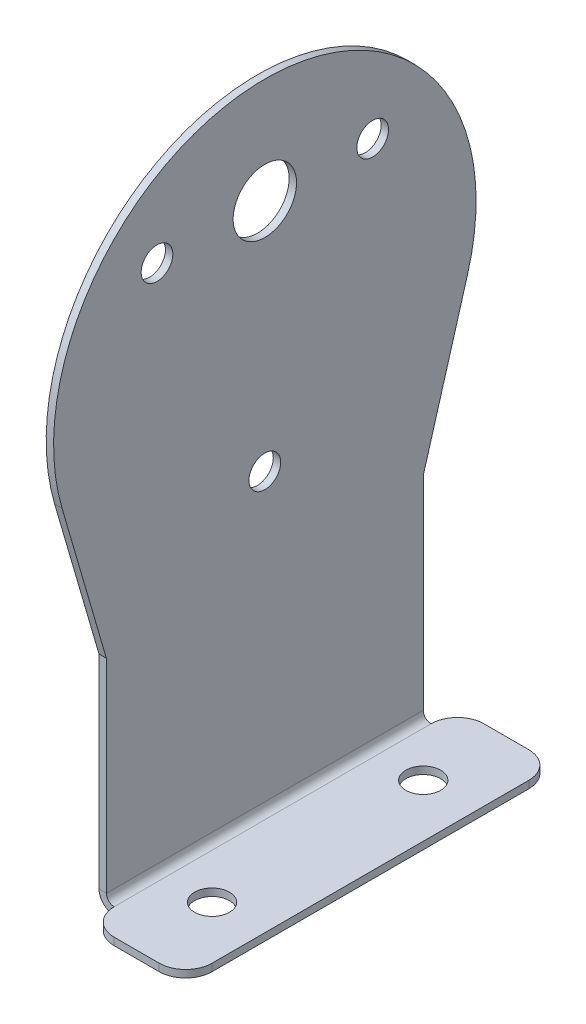
ISO-10303-21;
HEADER;
FILE_DESCRIPTION(('STEP AP214'),'2;1');
FILE_NAME('part.step','',(''),(''),'','','');
FILE_SCHEMA(('AUTOMOTIVE_DESIGN { 1 0 10303 214 1 1 1 1 }'));
ENDSEC;
DATA;
#1=APPLICATION_CONTEXT('core data for automotive mechanical design processes');
#2=APPLICATION_PROTOCOL_DEFINITION('international standard','automotive_design',2000,#1);
#3=PRODUCT_CONTEXT('',#1,'mechanical');
#4=PRODUCT('Part','Part','',(#3));
#5=PRODUCT_RELATED_PRODUCT_CATEGORY('part','',(#4));
#6=PRODUCT_DEFINITION_FORMATION('','',#4);
#7=PRODUCT_DEFINITION_CONTEXT('part definition',#1,'design');
#8=PRODUCT_DEFINITION('design','',#6,#7);
#9=PRODUCT_DEFINITION_SHAPE('','',#8);
#10=(LENGTH_UNIT() NAMED_UNIT(*) SI_UNIT(.MILLI.,.METRE.));
#11=(NAMED_UNIT(*) PLANE_ANGLE_UNIT() SI_UNIT($,.RADIAN.));
#12=(NAMED_UNIT(*) SI_UNIT($,.STERADIAN.) SOLID_ANGLE_UNIT());
#13=UNCERTAINTY_MEASURE_WITH_UNIT(LENGTH_MEASURE(1.E-05),#10,'distance_accuracy_value','');
#14=(GEOMETRIC_REPRESENTATION_CONTEXT(3) GLOBAL_UNCERTAINTY_ASSIGNED_CONTEXT((#13)) GLOBAL_UNIT_ASSIGNED_CONTEXT((#10,
#11,#12)) REPRESENTATION_CONTEXT('',''));
#15=CARTESIAN_POINT('',(0.,0.,0.));
#16=DIRECTION('',(0.,0.,1.));
#17=DIRECTION('',(1.,0.,0.));
#18=AXIS2_PLACEMENT_3D('',#15,#16,#17);
#19=CARTESIAN_POINT('',(-0.7,-20.,-15.));
#20=DIRECTION('',(0.,0.,-1.));
#21=DIRECTION('',(0.,1.,0.));
#22=AXIS2_PLACEMENT_3D('',#19,#20,#21);
#23=PLANE('',#22);
#24=DIRECTION('',(0.,1.,0.));
#25=VECTOR('',#24,1.);
#26=CARTESIAN_POINT('',(0.,-20.,-15.));
#27=LINE('',#26,#25);
#28=CARTESIAN_POINT('',(0.,-39.2634,-15.));
#29=VERTEX_POINT('',#28);
#30=CARTESIAN_POINT('',(0.,-20.,-15.));
#31=VERTEX_POINT('',#30);
#32=EDGE_CURVE('E257',#29,#31,#27,.T.);
#33=ORIENTED_EDGE('',*,*,#32,.F.);
#34=DIRECTION('',(-1.,0.,0.));
#35=VECTOR('',#34,1.);
#36=CARTESIAN_POINT('',(0.,-39.2634,-15.));
#37=LINE('',#36,#35);
#38=CARTESIAN_POINT('',(-0.700000000000004,-39.2634,-15.));
#39=VERTEX_POINT('',#38);
#40=EDGE_CURVE('E222',#29,#39,#37,.T.);
#41=ORIENTED_EDGE('',*,*,#40,.T.);
#42=DIRECTION('',(0.,1.,0.));
#43=VECTOR('',#42,1.);
#44=CARTESIAN_POINT('',(-0.7,-20.,-15.));
#45=LINE('',#44,#43);
#46=CARTESIAN_POINT('',(-0.7,-20.,-15.));
#47=VERTEX_POINT('',#46);
#48=EDGE_CURVE('E260',#39,#47,#45,.T.);
#49=ORIENTED_EDGE('',*,*,#48,.T.);
#50=DIRECTION('',(1.,0.,0.));
#51=VECTOR('',#50,1.);
#52=CARTESIAN_POINT('',(-0.7,-20.,-15.));
#53=LINE('',#52,#51);
#54=EDGE_CURVE('E275',#47,#31,#53,.T.);
#55=ORIENTED_EDGE('',*,*,#54,.T.);
#56=EDGE_LOOP('',(#33,#41,#49,#55));
#57=FACE_BOUND('',#56,.T.);
#58=ADVANCED_FACE('F36',(#57),#23,.T.);
#59=CARTESIAN_POINT('',(-0.7,0.,0.));
#60=DIRECTION('',(1.,0.,0.));
#61=DIRECTION('',(0.,0.,-1.));
#62=AXIS2_PLACEMENT_3D('',#59,#60,#61);
#63=PLANE('',#62);
#64=CARTESIAN_POINT('',(-0.7,10.,10.2108));
#65=DIRECTION('',(1.,0.,0.));
#66=DIRECTION('',(0.,0.,-1.));
#67=AXIS2_PLACEMENT_3D('',#64,#65,#66);
#68=CIRCLE('',#67,1.5);
#69=CARTESIAN_POINT('',(-0.7,10.,8.7108));
#70=VERTEX_POINT('',#69);
#71=EDGE_CURVE('E254',#70,#70,#68,.T.);
#72=ORIENTED_EDGE('',*,*,#71,.T.);
#73=EDGE_LOOP('',(#72));
#74=FACE_BOUND('',#73,.T.);
#75=CARTESIAN_POINT('',(-0.7,10.,-10.2108));
#76=DIRECTION('',(1.,0.,0.));
#77=DIRECTION('',(0.,0.,-1.));
#78=AXIS2_PLACEMENT_3D('',#75,#76,#77);
#79=CIRCLE('',#78,1.5);
#80=CARTESIAN_POINT('',(-0.7,10.,-11.7108));
#81=VERTEX_POINT('',#80);
#82=EDGE_CURVE('E248',#81,#81,#79,.T.);
#83=ORIENTED_EDGE('',*,*,#82,.T.);
#84=EDGE_LOOP('',(#83));
#85=FACE_BOUND('',#84,.T.);
#86=CARTESIAN_POINT('',(-0.7,10.,0.));
#87=DIRECTION('',(1.,0.,0.));
#88=DIRECTION('',(0.,0.,-1.));
#89=AXIS2_PLACEMENT_3D('',#86,#87,#88);
#90=CIRCLE('',#89,3.);
#91=CARTESIAN_POINT('',(-0.7,10.,-3.));
#92=VERTEX_POINT('',#91);
#93=EDGE_CURVE('E242',#92,#92,#90,.T.);
#94=ORIENTED_EDGE('',*,*,#93,.T.);
#95=EDGE_LOOP('',(#94));
#96=FACE_BOUND('',#95,.T.);
#97=CARTESIAN_POINT('',(-0.7,-12.1742,0.));
#98=DIRECTION('',(1.,0.,0.));
#99=DIRECTION('',(0.,0.,-1.));
#100=AXIS2_PLACEMENT_3D('',#97,#98,#99);
#101=CIRCLE('',#100,1.5);
#102=CARTESIAN_POINT('',(-0.7,-12.1742,-1.5));
#103=VERTEX_POINT('',#102);
#104=EDGE_CURVE('E236',#103,#103,#101,.T.);
#105=ORIENTED_EDGE('',*,*,#104,.T.);
#106=EDGE_LOOP('',(#105));
#107=FACE_BOUND('',#106,.T.);
#108=DIRECTION('',(0.,0.,-1.));
#109=VECTOR('',#108,1.);
#110=CARTESIAN_POINT('',(-0.700000000000004,-39.2634,-15.));
#111=LINE('',#110,#109);
#112=CARTESIAN_POINT('',(-0.7,-39.2634,15.));
#113=VERTEX_POINT('',#112);
#114=EDGE_CURVE('E145',#39,#113,#111,.F.);
#115=ORIENTED_EDGE('',*,*,#114,.T.);
#116=DIRECTION('',(0.,-1.,0.));
#117=VECTOR('',#116,1.);
#118=CARTESIAN_POINT('',(-0.7,-20.,15.));
#119=LINE('',#118,#117);
#120=CARTESIAN_POINT('',(-0.7,-20.,15.));
#121=VERTEX_POINT('',#120);
#122=EDGE_CURVE('E272',#121,#113,#119,.T.);
#123=ORIENTED_EDGE('',*,*,#122,.F.);
#124=DIRECTION('',(0.,-0.96,-0.28));
#125=VECTOR('',#124,1.);
#126=CARTESIAN_POINT('',(-0.7,-5.6,19.2));
#127=LINE('',#126,#125);
#128=CARTESIAN_POINT('',(-0.7,-5.6,19.2));
#129=VERTEX_POINT('',#128);
#130=EDGE_CURVE('E269',#129,#121,#127,.T.);
#131=ORIENTED_EDGE('',*,*,#130,.F.);
#132=CARTESIAN_POINT('',(-0.7,0.,0.));
#133=DIRECTION('',(1.,0.,0.));
#134=DIRECTION('',(0.,0.,-1.));
#135=AXIS2_PLACEMENT_3D('',#132,#133,#134);
#136=CIRCLE('',#135,20.);
#137=CARTESIAN_POINT('',(-0.7,-5.60000000000001,-19.2));
#138=VERTEX_POINT('',#137);
#139=EDGE_CURVE('E266',#138,#129,#136,.T.);
#140=ORIENTED_EDGE('',*,*,#139,.F.);
#141=DIRECTION('',(0.,0.96,-0.28));
#142=VECTOR('',#141,1.);
#143=CARTESIAN_POINT('',(-0.7,-20.,-15.));
#144=LINE('',#143,#142);
#145=EDGE_CURVE('E262',#47,#138,#144,.T.);
#146=ORIENTED_EDGE('',*,*,#145,.F.);
#147=ORIENTED_EDGE('',*,*,#48,.F.);
#148=EDGE_LOOP('',(#115,#123,#131,#140,#146,#147));
#149=FACE_BOUND('',#148,.T.);
#150=ADVANCED_FACE('F358',(#74,#85,#96,#107,#149),#63,.F.);
#151=CARTESIAN_POINT('',(0.,0.,0.));
#152=DIRECTION('',(1.,0.,0.));
#153=DIRECTION('',(0.,0.,-1.));
#154=AXIS2_PLACEMENT_3D('',#151,#152,#153);
#155=PLANE('',#154);
#156=CARTESIAN_POINT('',(0.,10.,10.2108));
#157=DIRECTION('',(1.,0.,0.));
#158=DIRECTION('',(0.,0.,-1.));
#159=AXIS2_PLACEMENT_3D('',#156,#157,#158);
#160=CIRCLE('',#159,1.5);
#161=CARTESIAN_POINT('',(0.,10.,8.7108));
#162=VERTEX_POINT('',#161);
#163=EDGE_CURVE('E251',#162,#162,#160,.T.);
#164=ORIENTED_EDGE('',*,*,#163,.F.);
#165=EDGE_LOOP('',(#164));
#166=FACE_BOUND('',#165,.T.);
#167=CARTESIAN_POINT('',(0.,10.,-10.2108));
#168=DIRECTION('',(1.,0.,0.));
#169=DIRECTION('',(0.,0.,-1.));
#170=AXIS2_PLACEMENT_3D('',#167,#168,#169);
#171=CIRCLE('',#170,1.5);
#172=CARTESIAN_POINT('',(0.,10.,-11.7108));
#173=VERTEX_POINT('',#172);
#174=EDGE_CURVE('E245',#173,#173,#171,.T.);
#175=ORIENTED_EDGE('',*,*,#174,.F.);
#176=EDGE_LOOP('',(#175));
#177=FACE_BOUND('',#176,.T.);
#178=CARTESIAN_POINT('',(0.,10.,0.));
#179=DIRECTION('',(1.,0.,0.));
#180=DIRECTION('',(0.,0.,-1.));
#181=AXIS2_PLACEMENT_3D('',#178,#179,#180);
#182=CIRCLE('',#181,3.);
#183=CARTESIAN_POINT('',(0.,10.,-3.));
#184=VERTEX_POINT('',#183);
#185=EDGE_CURVE('E239',#184,#184,#182,.T.);
#186=ORIENTED_EDGE('',*,*,#185,.F.);
#187=EDGE_LOOP('',(#186));
#188=FACE_BOUND('',#187,.T.);
#189=CARTESIAN_POINT('',(0.,-12.1742,0.));
#190=DIRECTION('',(1.,0.,0.));
#191=DIRECTION('',(0.,0.,-1.));
#192=AXIS2_PLACEMENT_3D('',#189,#190,#191);
#193=CIRCLE('',#192,1.5);
#194=CARTESIAN_POINT('',(0.,-12.1742,-1.5));
#195=VERTEX_POINT('',#194);
#196=EDGE_CURVE('E233',#195,#195,#193,.T.);
#197=ORIENTED_EDGE('',*,*,#196,.F.);
#198=EDGE_LOOP('',(#197));
#199=FACE_BOUND('',#198,.T.);
#200=DIRECTION('',(0.,-1.,0.));
#201=VECTOR('',#200,1.);
#202=CARTESIAN_POINT('',(0.,-20.,15.));
#203=LINE('',#202,#201);
#204=CARTESIAN_POINT('',(0.,-20.,15.));
#205=VERTEX_POINT('',#204);
#206=CARTESIAN_POINT('',(0.,-39.2634,15.));
#207=VERTEX_POINT('',#206);
#208=EDGE_CURVE('E263',#205,#207,#203,.T.);
#209=ORIENTED_EDGE('',*,*,#208,.T.);
#210=DIRECTION('',(0.,0.,-1.));
#211=VECTOR('',#210,1.);
#212=CARTESIAN_POINT('',(0.,-39.2634,-15.));
#213=LINE('',#212,#211);
#214=EDGE_CURVE('E226',#29,#207,#213,.F.);
#215=ORIENTED_EDGE('',*,*,#214,.F.);
#216=ORIENTED_EDGE('',*,*,#32,.T.);
#217=DIRECTION('',(0.,0.96,-0.28));
#218=VECTOR('',#217,1.);
#219=CARTESIAN_POINT('',(0.,-20.,-15.));
#220=LINE('',#219,#218);
#221=CARTESIAN_POINT('',(0.,-5.60000000000001,-19.2));
#222=VERTEX_POINT('',#221);
#223=EDGE_CURVE('E277',#31,#222,#220,.T.);
#224=ORIENTED_EDGE('',*,*,#223,.T.);
#225=CARTESIAN_POINT('',(0.,0.,0.));
#226=DIRECTION('',(1.,0.,0.));
#227=DIRECTION('',(0.,0.,-1.));
#228=AXIS2_PLACEMENT_3D('',#225,#226,#227);
#229=CIRCLE('',#228,20.);
#230=CARTESIAN_POINT('',(0.,-5.6,19.2));
#231=VERTEX_POINT('',#230);
#232=EDGE_CURVE('E280',#222,#231,#229,.T.);
#233=ORIENTED_EDGE('',*,*,#232,.T.);
#234=DIRECTION('',(0.,-0.96,-0.28));
#235=VECTOR('',#234,1.);
#236=CARTESIAN_POINT('',(0.,-5.6,19.2));
#237=LINE('',#236,#235);
#238=EDGE_CURVE('E283',#231,#205,#237,.T.);
#239=ORIENTED_EDGE('',*,*,#238,.T.);
#240=EDGE_LOOP('',(#209,#215,#216,#224,#233,#239));
#241=FACE_BOUND('',#240,.T.);
#242=ADVANCED_FACE('F302',(#166,#177,#188,#199,#241),#155,.T.);
#243=CARTESIAN_POINT('',(-0.7,-20.,15.));
#244=DIRECTION('',(0.,0.,1.));
#245=DIRECTION('',(0.,-1.,0.));
#246=AXIS2_PLACEMENT_3D('',#243,#244,#245);
#247=PLANE('',#246);
#248=DIRECTION('',(-1.,0.,0.));
#249=VECTOR('',#248,1.);
#250=CARTESIAN_POINT('',(0.,-39.2634,15.));
#251=LINE('',#250,#249);
#252=EDGE_CURVE('E230',#207,#113,#251,.T.);
#253=ORIENTED_EDGE('',*,*,#252,.F.);
#254=ORIENTED_EDGE('',*,*,#208,.F.);
#255=DIRECTION('',(1.,0.,0.));
#256=VECTOR('',#255,1.);
#257=CARTESIAN_POINT('',(-0.7,-20.,15.));
#258=LINE('',#257,#256);
#259=EDGE_CURVE('E201',#121,#205,#258,.T.);
#260=ORIENTED_EDGE('',*,*,#259,.F.);
#261=ORIENTED_EDGE('',*,*,#122,.T.);
#262=EDGE_LOOP('',(#253,#254,#260,#261));
#263=FACE_BOUND('',#262,.T.);
#264=ADVANCED_FACE('F376',(#263),#247,.T.);
#265=CARTESIAN_POINT('',(-0.7,-5.6,19.2));
#266=DIRECTION('',(0.,-0.28,0.96));
#267=DIRECTION('',(0.,-0.96,-0.28));
#268=AXIS2_PLACEMENT_3D('',#265,#266,#267);
#269=PLANE('',#268);
#270=ORIENTED_EDGE('',*,*,#238,.F.);
#271=DIRECTION('',(1.,0.,0.));
#272=VECTOR('',#271,1.);
#273=CARTESIAN_POINT('',(-0.7,-5.6,19.2));
#274=LINE('',#273,#272);
#275=EDGE_CURVE('E289',#129,#231,#274,.T.);
#276=ORIENTED_EDGE('',*,*,#275,.F.);
#277=ORIENTED_EDGE('',*,*,#130,.T.);
#278=ORIENTED_EDGE('',*,*,#259,.T.);
#279=EDGE_LOOP('',(#270,#276,#277,#278));
#280=FACE_BOUND('',#279,.T.);
#281=ADVANCED_FACE('F372',(#280),#269,.T.);
#282=CARTESIAN_POINT('',(-0.7,0.,0.));
#283=DIRECTION('',(1.,0.,0.));
#284=DIRECTION('',(0.,0.,-1.));
#285=AXIS2_PLACEMENT_3D('',#282,#283,#284);
#286=CYLINDRICAL_SURFACE('',#285,20.);
#287=ORIENTED_EDGE('',*,*,#232,.F.);
#288=DIRECTION('',(1.,0.,0.));
#289=VECTOR('',#288,1.);
#290=CARTESIAN_POINT('',(-0.7,-5.60000000000001,-19.2));
#291=LINE('',#290,#289);
#292=EDGE_CURVE('E291',#138,#222,#291,.T.);
#293=ORIENTED_EDGE('',*,*,#292,.F.);
#294=ORIENTED_EDGE('',*,*,#139,.T.);
#295=ORIENTED_EDGE('',*,*,#275,.T.);
#296=EDGE_LOOP('',(#287,#293,#294,#295));
#297=FACE_BOUND('',#296,.T.);
#298=ADVANCED_FACE('F369',(#297),#286,.T.);
#299=CARTESIAN_POINT('',(-0.7,-20.,-15.));
#300=DIRECTION('',(0.,-0.28,-0.96));
#301=DIRECTION('',(0.,0.96,-0.28));
#302=AXIS2_PLACEMENT_3D('',#299,#300,#301);
#303=PLANE('',#302);
#304=ORIENTED_EDGE('',*,*,#223,.F.);
#305=ORIENTED_EDGE('',*,*,#54,.F.);
#306=ORIENTED_EDGE('',*,*,#145,.T.);
#307=ORIENTED_EDGE('',*,*,#292,.T.);
#308=EDGE_LOOP('',(#304,#305,#306,#307));
#309=FACE_BOUND('',#308,.T.);
#310=ADVANCED_FACE('F299',(#309),#303,.T.);
#311=CARTESIAN_POINT('',(-0.7,10.,10.2108));
#312=DIRECTION('',(1.,0.,0.));
#313=DIRECTION('',(0.,0.,-1.));
#314=AXIS2_PLACEMENT_3D('',#311,#312,#313);
#315=CYLINDRICAL_SURFACE('',#314,1.5);
#316=ORIENTED_EDGE('',*,*,#71,.F.);
#317=EDGE_LOOP('',(#316));
#318=FACE_BOUND('',#317,.T.);
#319=ORIENTED_EDGE('',*,*,#163,.T.);
#320=EDGE_LOOP('',(#319));
#321=FACE_BOUND('',#320,.T.);
#322=ADVANCED_FACE('F368',(#318,#321),#315,.F.);
#323=CARTESIAN_POINT('',(-0.7,10.,-10.2108));
#324=DIRECTION('',(1.,0.,0.));
#325=DIRECTION('',(0.,0.,-1.));
#326=AXIS2_PLACEMENT_3D('',#323,#324,#325);
#327=CYLINDRICAL_SURFACE('',#326,1.5);
#328=ORIENTED_EDGE('',*,*,#82,.F.);
#329=EDGE_LOOP('',(#328));
#330=FACE_BOUND('',#329,.T.);
#331=ORIENTED_EDGE('',*,*,#174,.T.);
#332=EDGE_LOOP('',(#331));
#333=FACE_BOUND('',#332,.T.);
#334=ADVANCED_FACE('F386',(#330,#333),#327,.F.);
#335=CARTESIAN_POINT('',(-0.7,10.,0.));
#336=DIRECTION('',(1.,0.,0.));
#337=DIRECTION('',(0.,0.,-1.));
#338=AXIS2_PLACEMENT_3D('',#335,#336,#337);
#339=CYLINDRICAL_SURFACE('',#338,3.);
#340=ORIENTED_EDGE('',*,*,#93,.F.);
#341=EDGE_LOOP('',(#340));
#342=FACE_BOUND('',#341,.T.);
#343=ORIENTED_EDGE('',*,*,#185,.T.);
#344=EDGE_LOOP('',(#343));
#345=FACE_BOUND('',#344,.T.);
#346=ADVANCED_FACE('F390',(#342,#345),#339,.F.);
#347=CARTESIAN_POINT('',(-0.7,-12.1742,0.));
#348=DIRECTION('',(1.,0.,0.));
#349=DIRECTION('',(0.,0.,-1.));
#350=AXIS2_PLACEMENT_3D('',#347,#348,#349);
#351=CYLINDRICAL_SURFACE('',#350,1.5);
#352=ORIENTED_EDGE('',*,*,#104,.F.);
#353=EDGE_LOOP('',(#352));
#354=FACE_BOUND('',#353,.T.);
#355=ORIENTED_EDGE('',*,*,#196,.T.);
#356=EDGE_LOOP('',(#355));
#357=FACE_BOUND('',#356,.T.);
#358=ADVANCED_FACE('F394',(#354,#357),#351,.F.);
#359=CARTESIAN_POINT('',(0.736599999999999,-39.2634,15.));
#360=DIRECTION('',(0.,0.,1.));
#361=DIRECTION('',(1.,0.,0.));
#362=AXIS2_PLACEMENT_3D('',#359,#360,#361);
#363=PLANE('',#362);
#364=DIRECTION('',(0.,-1.,0.));
#365=VECTOR('',#364,1.);
#366=CARTESIAN_POINT('',(0.736599999999997,-40.,15.));
#367=LINE('',#366,#365);
#368=CARTESIAN_POINT('',(0.736599999999997,-40.,15.));
#369=VERTEX_POINT('',#368);
#370=CARTESIAN_POINT('',(0.736599999999994,-40.7,15.));
#371=VERTEX_POINT('',#370);
#372=EDGE_CURVE('E192',#369,#371,#367,.T.);
#373=ORIENTED_EDGE('',*,*,#372,.F.);
#374=CARTESIAN_POINT('',(0.736599999999999,-39.2634,15.));
#375=DIRECTION('',(0.,0.,-1.));
#376=DIRECTION('',(-1.,0.,0.));
#377=AXIS2_PLACEMENT_3D('',#374,#375,#376);
#378=CIRCLE('',#377,0.736599999999997);
#379=EDGE_CURVE('E148',#207,#369,#378,.F.);
#380=ORIENTED_EDGE('',*,*,#379,.F.);
#381=ORIENTED_EDGE('',*,*,#252,.T.);
#382=CARTESIAN_POINT('',(0.736599999999999,-39.2634,15.));
#383=DIRECTION('',(0.,0.,-1.));
#384=DIRECTION('',(-1.,0.,0.));
#385=AXIS2_PLACEMENT_3D('',#382,#383,#384);
#386=CIRCLE('',#385,1.4366);
#387=EDGE_CURVE('E221',#113,#371,#386,.F.);
#388=ORIENTED_EDGE('',*,*,#387,.T.);
#389=EDGE_LOOP('',(#373,#380,#381,#388));
#390=FACE_BOUND('',#389,.T.);
#391=ADVANCED_FACE('F311',(#390),#363,.T.);
#392=CARTESIAN_POINT('',(0.736599999999993,-39.2634,-15.));
#393=DIRECTION('',(0.,0.,1.));
#394=DIRECTION('',(1.,0.,0.));
#395=AXIS2_PLACEMENT_3D('',#392,#393,#394);
#396=PLANE('',#395);
#397=CARTESIAN_POINT('',(0.736599999999993,-39.2634,-15.));
#398=DIRECTION('',(0.,0.,-1.));
#399=DIRECTION('',(-1.,0.,0.));
#400=AXIS2_PLACEMENT_3D('',#397,#398,#399);
#401=CIRCLE('',#400,0.736599999999997);
#402=CARTESIAN_POINT('',(0.736599999999997,-40.,-15.));
#403=VERTEX_POINT('',#402);
#404=EDGE_CURVE('E155',#403,#29,#401,.T.);
#405=ORIENTED_EDGE('',*,*,#404,.F.);
#406=DIRECTION('',(0.,-1.,0.));
#407=VECTOR('',#406,1.);
#408=CARTESIAN_POINT('',(0.73659999999999,-40.,-15.));
#409=LINE('',#408,#407);
#410=CARTESIAN_POINT('',(0.736599999999994,-40.7,-15.));
#411=VERTEX_POINT('',#410);
#412=EDGE_CURVE('E152',#403,#411,#409,.T.);
#413=ORIENTED_EDGE('',*,*,#412,.T.);
#414=CARTESIAN_POINT('',(0.736599999999993,-39.2634,-15.));
#415=DIRECTION('',(0.,0.,-1.));
#416=DIRECTION('',(-1.,0.,0.));
#417=AXIS2_PLACEMENT_3D('',#414,#415,#416);
#418=CIRCLE('',#417,1.4366);
#419=EDGE_CURVE('E139',#411,#39,#418,.T.);
#420=ORIENTED_EDGE('',*,*,#419,.T.);
#421=ORIENTED_EDGE('',*,*,#40,.F.);
#422=EDGE_LOOP('',(#405,#413,#420,#421));
#423=FACE_BOUND('',#422,.T.);
#424=ADVANCED_FACE('F153',(#423),#396,.F.);
#425=CARTESIAN_POINT('',(0.736599999999993,-39.2634,-15.));
#426=DIRECTION('',(0.,0.,-1.));
#427=DIRECTION('',(0.,-1.,0.));
#428=AXIS2_PLACEMENT_3D('',#425,#426,#427);
#429=CYLINDRICAL_SURFACE('',#428,1.4366);
#430=ORIENTED_EDGE('',*,*,#114,.F.);
#431=ORIENTED_EDGE('',*,*,#419,.F.);
#432=DIRECTION('',(0.,0.,1.));
#433=VECTOR('',#432,1.);
#434=CARTESIAN_POINT('',(0.736599999999991,-40.7,0.));
#435=LINE('',#434,#433);
#436=EDGE_CURVE('E143',#411,#371,#435,.T.);
#437=ORIENTED_EDGE('',*,*,#436,.T.);
#438=ORIENTED_EDGE('',*,*,#387,.F.);
#439=EDGE_LOOP('',(#430,#431,#437,#438));
#440=FACE_BOUND('',#439,.T.);
#441=ADVANCED_FACE('F141',(#440),#429,.T.);
#442=CARTESIAN_POINT('',(0.736599999999993,-39.2634,-15.));
#443=DIRECTION('',(0.,0.,-1.));
#444=DIRECTION('',(0.,-1.,0.));
#445=AXIS2_PLACEMENT_3D('',#442,#443,#444);
#446=CYLINDRICAL_SURFACE('',#445,0.736599999999997);
#447=ORIENTED_EDGE('',*,*,#214,.T.);
#448=ORIENTED_EDGE('',*,*,#379,.T.);
#449=DIRECTION('',(0.,0.,-1.));
#450=VECTOR('',#449,1.);
#451=CARTESIAN_POINT('',(0.736599999999997,-40.,15.));
#452=LINE('',#451,#450);
#453=EDGE_CURVE('E157',#369,#403,#452,.T.);
#454=ORIENTED_EDGE('',*,*,#453,.T.);
#455=ORIENTED_EDGE('',*,*,#404,.T.);
#456=EDGE_LOOP('',(#447,#448,#454,#455));
#457=FACE_BOUND('',#456,.T.);
#458=ADVANCED_FACE('F306',(#457),#446,.F.);
#459=CARTESIAN_POINT('',(-1.41221915015335E-13,-40.7,0.));
#460=DIRECTION('',(0.,1.,0.));
#461=DIRECTION('',(-1.,0.,0.));
#462=AXIS2_PLACEMENT_3D('',#459,#460,#461);
#463=PLANE('',#462);
#464=CARTESIAN_POINT('',(4.99999999999993,-40.7,9.99999999999999));
#465=DIRECTION('',(0.,1.,0.));
#466=DIRECTION('',(1.,0.,0.));
#467=AXIS2_PLACEMENT_3D('',#464,#465,#466);
#468=CIRCLE('',#467,1.65);
#469=CARTESIAN_POINT('',(6.64999999999993,-40.7,9.99999999999999));
#470=VERTEX_POINT('',#469);
#471=EDGE_CURVE('E326',#470,#470,#468,.T.);
#472=ORIENTED_EDGE('',*,*,#471,.T.);
#473=EDGE_LOOP('',(#472));
#474=FACE_BOUND('',#473,.T.);
#475=CARTESIAN_POINT('',(4.99999999999993,-40.7,-10.));
#476=DIRECTION('',(0.,1.,0.));
#477=DIRECTION('',(-1.,0.,0.));
#478=AXIS2_PLACEMENT_3D('',#475,#476,#477);
#479=CIRCLE('',#478,1.65);
#480=CARTESIAN_POINT('',(3.34999999999993,-40.7,-10.));
#481=VERTEX_POINT('',#480);
#482=EDGE_CURVE('E321',#481,#481,#479,.T.);
#483=ORIENTED_EDGE('',*,*,#482,.T.);
#484=EDGE_LOOP('',(#483));
#485=FACE_BOUND('',#484,.T.);
#486=DIRECTION('',(0.,0.,1.));
#487=VECTOR('',#486,1.);
#488=CARTESIAN_POINT('',(10.,-40.7,15.));
#489=LINE('',#488,#487);
#490=CARTESIAN_POINT('',(10.,-40.7,-15.));
#491=VERTEX_POINT('',#490);
#492=CARTESIAN_POINT('',(10.,-40.7,15.));
#493=VERTEX_POINT('',#492);
#494=EDGE_CURVE('E180',#491,#493,#489,.T.);
#495=ORIENTED_EDGE('',*,*,#494,.T.);
#496=CARTESIAN_POINT('',(7.5,-40.7,15.));
#497=DIRECTION('',(0.,1.,0.));
#498=DIRECTION('',(-1.,0.,0.));
#499=AXIS2_PLACEMENT_3D('',#496,#497,#498);
#500=CIRCLE('',#499,2.5);
#501=CARTESIAN_POINT('',(7.5,-40.7,17.5));
#502=VERTEX_POINT('',#501);
#503=EDGE_CURVE('E170',#493,#502,#500,.F.);
#504=ORIENTED_EDGE('',*,*,#503,.T.);
#505=DIRECTION('',(1.,0.,0.));
#506=VECTOR('',#505,1.);
#507=CARTESIAN_POINT('',(0.736599999999995,-40.7,17.5));
#508=LINE('',#507,#506);
#509=CARTESIAN_POINT('',(3.23659999999999,-40.7,17.5));
#510=VERTEX_POINT('',#509);
#511=EDGE_CURVE('E178',#510,#502,#508,.T.);
#512=ORIENTED_EDGE('',*,*,#511,.F.);
#513=CARTESIAN_POINT('',(3.23659999999999,-40.7,15.));
#514=DIRECTION('',(0.,1.,0.));
#515=DIRECTION('',(-1.,0.,0.));
#516=AXIS2_PLACEMENT_3D('',#513,#514,#515);
#517=CIRCLE('',#516,2.5);
#518=EDGE_CURVE('E163',#510,#371,#517,.F.);
#519=ORIENTED_EDGE('',*,*,#518,.T.);
#520=ORIENTED_EDGE('',*,*,#436,.F.);
#521=CARTESIAN_POINT('',(3.23659999999999,-40.7,-15.));
#522=DIRECTION('',(0.,1.,0.));
#523=DIRECTION('',(-1.,0.,0.));
#524=AXIS2_PLACEMENT_3D('',#521,#522,#523);
#525=CIRCLE('',#524,2.5);
#526=CARTESIAN_POINT('',(3.23659999999999,-40.7,-17.5));
#527=VERTEX_POINT('',#526);
#528=EDGE_CURVE('E57',#411,#527,#525,.F.);
#529=ORIENTED_EDGE('',*,*,#528,.T.);
#530=DIRECTION('',(1.,0.,0.));
#531=VECTOR('',#530,1.);
#532=CARTESIAN_POINT('',(0.736599999999995,-40.7,-17.5));
#533=LINE('',#532,#531);
#534=CARTESIAN_POINT('',(7.5,-40.7,-17.5));
#535=VERTEX_POINT('',#534);
#536=EDGE_CURVE('E317',#527,#535,#533,.T.);
#537=ORIENTED_EDGE('',*,*,#536,.T.);
#538=CARTESIAN_POINT('',(7.5,-40.7,-15.));
#539=DIRECTION('',(0.,1.,0.));
#540=DIRECTION('',(-1.,0.,0.));
#541=AXIS2_PLACEMENT_3D('',#538,#539,#540);
#542=CIRCLE('',#541,2.5);
#543=EDGE_CURVE('E168',#535,#491,#542,.F.);
#544=ORIENTED_EDGE('',*,*,#543,.T.);
#545=EDGE_LOOP('',(#495,#504,#512,#519,#520,#529,#537,#544));
#546=FACE_BOUND('',#545,.T.);
#547=ADVANCED_FACE('F160',(#474,#485,#546),#463,.F.);
#548=CARTESIAN_POINT('',(-1.38777878078145E-13,-40.,0.));
#549=DIRECTION('',(0.,1.,0.));
#550=DIRECTION('',(-1.,0.,0.));
#551=AXIS2_PLACEMENT_3D('',#548,#549,#550);
#552=PLANE('',#551);
#553=CARTESIAN_POINT('',(4.99999999999993,-40.,9.99999999999999));
#554=DIRECTION('',(0.,1.,0.));
#555=DIRECTION('',(1.,0.,0.));
#556=AXIS2_PLACEMENT_3D('',#553,#554,#555);
#557=CIRCLE('',#556,1.65);
#558=CARTESIAN_POINT('',(6.64999999999993,-40.,9.99999999999999));
#559=VERTEX_POINT('',#558);
#560=EDGE_CURVE('E329',#559,#559,#557,.T.);
#561=ORIENTED_EDGE('',*,*,#560,.F.);
#562=EDGE_LOOP('',(#561));
#563=FACE_BOUND('',#562,.T.);
#564=CARTESIAN_POINT('',(4.99999999999993,-40.,-10.));
#565=DIRECTION('',(0.,1.,0.));
#566=DIRECTION('',(-1.,0.,0.));
#567=AXIS2_PLACEMENT_3D('',#564,#565,#566);
#568=CIRCLE('',#567,1.65);
#569=CARTESIAN_POINT('',(3.34999999999993,-40.,-10.));
#570=VERTEX_POINT('',#569);
#571=EDGE_CURVE('E323',#570,#570,#568,.T.);
#572=ORIENTED_EDGE('',*,*,#571,.F.);
#573=EDGE_LOOP('',(#572));
#574=FACE_BOUND('',#573,.T.);
#575=DIRECTION('',(1.,0.,0.));
#576=VECTOR('',#575,1.);
#577=CARTESIAN_POINT('',(0.736599999999997,-40.,17.5));
#578=LINE('',#577,#576);
#579=CARTESIAN_POINT('',(3.2366,-40.,17.5));
#580=VERTEX_POINT('',#579);
#581=CARTESIAN_POINT('',(7.5,-40.,17.5));
#582=VERTEX_POINT('',#581);
#583=EDGE_CURVE('E193',#580,#582,#578,.T.);
#584=ORIENTED_EDGE('',*,*,#583,.T.);
#585=CARTESIAN_POINT('',(7.5,-40.,15.));
#586=DIRECTION('',(0.,1.,0.));
#587=DIRECTION('',(-1.,0.,0.));
#588=AXIS2_PLACEMENT_3D('',#585,#586,#587);
#589=CIRCLE('',#588,2.5);
#590=CARTESIAN_POINT('',(10.,-40.,15.));
#591=VERTEX_POINT('',#590);
#592=EDGE_CURVE('E196',#582,#591,#589,.T.);
#593=ORIENTED_EDGE('',*,*,#592,.T.);
#594=DIRECTION('',(0.,0.,1.));
#595=VECTOR('',#594,1.);
#596=CARTESIAN_POINT('',(10.,-40.,15.));
#597=LINE('',#596,#595);
#598=CARTESIAN_POINT('',(10.,-40.,-15.));
#599=VERTEX_POINT('',#598);
#600=EDGE_CURVE('E164',#599,#591,#597,.T.);
#601=ORIENTED_EDGE('',*,*,#600,.F.);
#602=CARTESIAN_POINT('',(7.5,-40.,-15.));
#603=DIRECTION('',(0.,1.,0.));
#604=DIRECTION('',(-1.,0.,0.));
#605=AXIS2_PLACEMENT_3D('',#602,#603,#604);
#606=CIRCLE('',#605,2.5);
#607=CARTESIAN_POINT('',(7.5,-40.,-17.5));
#608=VERTEX_POINT('',#607);
#609=EDGE_CURVE('E197',#599,#608,#606,.T.);
#610=ORIENTED_EDGE('',*,*,#609,.T.);
#611=DIRECTION('',(1.,0.,0.));
#612=VECTOR('',#611,1.);
#613=CARTESIAN_POINT('',(0.736599999999997,-40.,-17.5));
#614=LINE('',#613,#612);
#615=CARTESIAN_POINT('',(3.2366,-40.,-17.5));
#616=VERTEX_POINT('',#615);
#617=EDGE_CURVE('E319',#616,#608,#614,.T.);
#618=ORIENTED_EDGE('',*,*,#617,.F.);
#619=CARTESIAN_POINT('',(3.2366,-40.,-15.));
#620=DIRECTION('',(0.,1.,0.));
#621=DIRECTION('',(-1.,0.,0.));
#622=AXIS2_PLACEMENT_3D('',#619,#620,#621);
#623=CIRCLE('',#622,2.5);
#624=EDGE_CURVE('E199',#616,#403,#623,.T.);
#625=ORIENTED_EDGE('',*,*,#624,.T.);
#626=ORIENTED_EDGE('',*,*,#453,.F.);
#627=CARTESIAN_POINT('',(3.2366,-40.,15.));
#628=DIRECTION('',(0.,1.,0.));
#629=DIRECTION('',(-1.,0.,0.));
#630=AXIS2_PLACEMENT_3D('',#627,#628,#629);
#631=CIRCLE('',#630,2.5);
#632=EDGE_CURVE('E206',#369,#580,#631,.T.);
#633=ORIENTED_EDGE('',*,*,#632,.T.);
#634=EDGE_LOOP('',(#584,#593,#601,#610,#618,#625,#626,#633));
#635=FACE_BOUND('',#634,.T.);
#636=ADVANCED_FACE('F344',(#563,#574,#635),#552,.T.);
#637=CARTESIAN_POINT('',(10.,-40.7,15.));
#638=DIRECTION('',(-1.,0.,0.));
#639=DIRECTION('',(0.,-1.,0.));
#640=AXIS2_PLACEMENT_3D('',#637,#638,#639);
#641=PLANE('',#640);
#642=ORIENTED_EDGE('',*,*,#600,.T.);
#643=DIRECTION('',(0.,1.,0.));
#644=VECTOR('',#643,1.);
#645=CARTESIAN_POINT('',(10.,-40.7,15.));
#646=LINE('',#645,#644);
#647=EDGE_CURVE('E172',#591,#493,#646,.F.);
#648=ORIENTED_EDGE('',*,*,#647,.T.);
#649=ORIENTED_EDGE('',*,*,#494,.F.);
#650=DIRECTION('',(0.,1.,0.));
#651=VECTOR('',#650,1.);
#652=CARTESIAN_POINT('',(10.,-40.7,-15.));
#653=LINE('',#652,#651);
#654=EDGE_CURVE('E209',#491,#599,#653,.T.);
#655=ORIENTED_EDGE('',*,*,#654,.T.);
#656=EDGE_LOOP('',(#642,#648,#649,#655));
#657=FACE_BOUND('',#656,.T.);
#658=ADVANCED_FACE('F213',(#657),#641,.F.);
#659=CARTESIAN_POINT('',(0.736599999999995,-40.7,17.5));
#660=DIRECTION('',(0.,0.,1.));
#661=DIRECTION('',(0.,-1.,0.));
#662=AXIS2_PLACEMENT_3D('',#659,#660,#661);
#663=PLANE('',#662);
#664=ORIENTED_EDGE('',*,*,#511,.T.);
#665=DIRECTION('',(0.,1.,0.));
#666=VECTOR('',#665,1.);
#667=CARTESIAN_POINT('',(7.5,-40.,17.5));
#668=LINE('',#667,#666);
#669=EDGE_CURVE('E188',#502,#582,#668,.T.);
#670=ORIENTED_EDGE('',*,*,#669,.T.);
#671=ORIENTED_EDGE('',*,*,#583,.F.);
#672=DIRECTION('',(0.,1.,0.));
#673=VECTOR('',#672,1.);
#674=CARTESIAN_POINT('',(3.23659999999999,-40.7,17.5));
#675=LINE('',#674,#673);
#676=EDGE_CURVE('E191',#580,#510,#675,.F.);
#677=ORIENTED_EDGE('',*,*,#676,.T.);
#678=EDGE_LOOP('',(#664,#670,#671,#677));
#679=FACE_BOUND('',#678,.T.);
#680=ADVANCED_FACE('F186',(#679),#663,.T.);
#681=CARTESIAN_POINT('',(0.736599999999995,-40.7,-17.5));
#682=DIRECTION('',(0.,0.,1.));
#683=DIRECTION('',(0.,-1.,0.));
#684=AXIS2_PLACEMENT_3D('',#681,#682,#683);
#685=PLANE('',#684);
#686=ORIENTED_EDGE('',*,*,#536,.F.);
#687=DIRECTION('',(0.,1.,0.));
#688=VECTOR('',#687,1.);
#689=CARTESIAN_POINT('',(3.23659999999999,-40.7,-17.5));
#690=LINE('',#689,#688);
#691=EDGE_CURVE('E11',#527,#616,#690,.T.);
#692=ORIENTED_EDGE('',*,*,#691,.T.);
#693=ORIENTED_EDGE('',*,*,#617,.T.);
#694=DIRECTION('',(0.,1.,0.));
#695=VECTOR('',#694,1.);
#696=CARTESIAN_POINT('',(7.5,-40.7,-17.5));
#697=LINE('',#696,#695);
#698=EDGE_CURVE('E44',#608,#535,#697,.F.);
#699=ORIENTED_EDGE('',*,*,#698,.T.);
#700=EDGE_LOOP('',(#686,#692,#693,#699));
#701=FACE_BOUND('',#700,.T.);
#702=ADVANCED_FACE('F413',(#701),#685,.F.);
#703=CARTESIAN_POINT('',(4.99999999999993,-40.7,-10.));
#704=DIRECTION('',(0.,1.,0.));
#705=DIRECTION('',(-1.,0.,0.));
#706=AXIS2_PLACEMENT_3D('',#703,#704,#705);
#707=CYLINDRICAL_SURFACE('',#706,1.65);
#708=ORIENTED_EDGE('',*,*,#482,.F.);
#709=EDGE_LOOP('',(#708));
#710=FACE_BOUND('',#709,.T.);
#711=ORIENTED_EDGE('',*,*,#571,.T.);
#712=EDGE_LOOP('',(#711));
#713=FACE_BOUND('',#712,.T.);
#714=ADVANCED_FACE('F340',(#710,#713),#707,.F.);
#715=CARTESIAN_POINT('',(4.99999999999993,-40.7,9.99999999999999));
#716=DIRECTION('',(0.,1.,0.));
#717=DIRECTION('',(-1.,0.,0.));
#718=AXIS2_PLACEMENT_3D('',#715,#716,#717);
#719=CYLINDRICAL_SURFACE('',#718,1.65);
#720=ORIENTED_EDGE('',*,*,#471,.F.);
#721=EDGE_LOOP('',(#720));
#722=FACE_BOUND('',#721,.T.);
#723=ORIENTED_EDGE('',*,*,#560,.T.);
#724=EDGE_LOOP('',(#723));
#725=FACE_BOUND('',#724,.T.);
#726=ADVANCED_FACE('F337',(#722,#725),#719,.F.);
#727=CARTESIAN_POINT('',(7.5,-40.7,15.));
#728=DIRECTION('',(0.,-1.,0.));
#729=DIRECTION('',(1.,0.,0.));
#730=AXIS2_PLACEMENT_3D('',#727,#728,#729);
#731=CYLINDRICAL_SURFACE('',#730,2.5);
#732=ORIENTED_EDGE('',*,*,#503,.F.);
#733=ORIENTED_EDGE('',*,*,#647,.F.);
#734=ORIENTED_EDGE('',*,*,#592,.F.);
#735=ORIENTED_EDGE('',*,*,#669,.F.);
#736=EDGE_LOOP('',(#732,#733,#734,#735));
#737=FACE_BOUND('',#736,.T.);
#738=ADVANCED_FACE('F195',(#737),#731,.T.);
#739=CARTESIAN_POINT('',(3.23659999999999,-40.7,15.));
#740=DIRECTION('',(0.,1.,0.));
#741=DIRECTION('',(-1.,0.,0.));
#742=AXIS2_PLACEMENT_3D('',#739,#740,#741);
#743=CYLINDRICAL_SURFACE('',#742,2.5);
#744=ORIENTED_EDGE('',*,*,#518,.F.);
#745=ORIENTED_EDGE('',*,*,#676,.F.);
#746=ORIENTED_EDGE('',*,*,#632,.F.);
#747=ORIENTED_EDGE('',*,*,#372,.T.);
#748=EDGE_LOOP('',(#744,#745,#746,#747));
#749=FACE_BOUND('',#748,.T.);
#750=ADVANCED_FACE('F349',(#749),#743,.T.);
#751=CARTESIAN_POINT('',(3.23659999999999,-40.7,-15.));
#752=DIRECTION('',(0.,1.,0.));
#753=DIRECTION('',(-1.,0.,0.));
#754=AXIS2_PLACEMENT_3D('',#751,#752,#753);
#755=CYLINDRICAL_SURFACE('',#754,2.5);
#756=ORIENTED_EDGE('',*,*,#528,.F.);
#757=ORIENTED_EDGE('',*,*,#412,.F.);
#758=ORIENTED_EDGE('',*,*,#624,.F.);
#759=ORIENTED_EDGE('',*,*,#691,.F.);
#760=EDGE_LOOP('',(#756,#757,#758,#759));
#761=FACE_BOUND('',#760,.T.);
#762=ADVANCED_FACE('F167',(#761),#755,.T.);
#763=CARTESIAN_POINT('',(7.5,-40.7,-15.));
#764=DIRECTION('',(0.,1.,0.));
#765=DIRECTION('',(-1.,0.,0.));
#766=AXIS2_PLACEMENT_3D('',#763,#764,#765);
#767=CYLINDRICAL_SURFACE('',#766,2.5);
#768=ORIENTED_EDGE('',*,*,#543,.F.);
#769=ORIENTED_EDGE('',*,*,#698,.F.);
#770=ORIENTED_EDGE('',*,*,#609,.F.);
#771=ORIENTED_EDGE('',*,*,#654,.F.);
#772=EDGE_LOOP('',(#768,#769,#770,#771));
#773=FACE_BOUND('',#772,.T.);
#774=ADVANCED_FACE('F38',(#773),#767,.T.);
#775=CLOSED_SHELL('',(#58,#150,#242,#264,#281,#298,#310,#322,#334,#346,#358,#391,#424,#441,#458,
#547,#636,#658,#680,#702,#714,#726,#738,#750,#762,#774));
#776=MANIFOLD_SOLID_BREP('B2',#775);
#777=ADVANCED_BREP_SHAPE_REPRESENTATION('',(#18,#776),#14);
#778=SHAPE_DEFINITION_REPRESENTATION(#9,#777);
ENDSEC;
END-ISO-10303-21;
